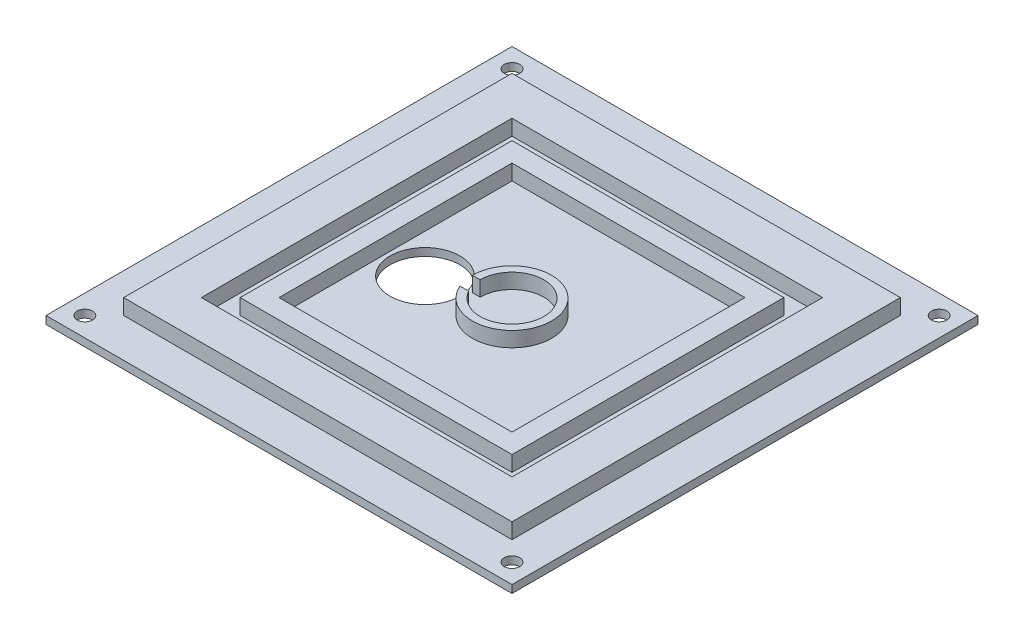
ISO-10303-21;
HEADER;
FILE_DESCRIPTION(('STEP AP214'),'2;1');
FILE_NAME('part.step','',(''),(''),'','','');
FILE_SCHEMA(('AUTOMOTIVE_DESIGN { 1 0 10303 214 1 1 1 1 }'));
ENDSEC;
DATA;
#1=APPLICATION_CONTEXT('core data for automotive mechanical design processes');
#2=APPLICATION_PROTOCOL_DEFINITION('international standard','automotive_design',2000,#1);
#3=PRODUCT_CONTEXT('',#1,'mechanical');
#4=PRODUCT('Part','Part','',(#3));
#5=PRODUCT_RELATED_PRODUCT_CATEGORY('part','',(#4));
#6=PRODUCT_DEFINITION_FORMATION('','',#4);
#7=PRODUCT_DEFINITION_CONTEXT('part definition',#1,'design');
#8=PRODUCT_DEFINITION('design','',#6,#7);
#9=PRODUCT_DEFINITION_SHAPE('','',#8);
#10=(LENGTH_UNIT() NAMED_UNIT(*) SI_UNIT(.MILLI.,.METRE.));
#11=(NAMED_UNIT(*) PLANE_ANGLE_UNIT() SI_UNIT($,.RADIAN.));
#12=(NAMED_UNIT(*) SI_UNIT($,.STERADIAN.) SOLID_ANGLE_UNIT());
#13=UNCERTAINTY_MEASURE_WITH_UNIT(LENGTH_MEASURE(1.E-05),#10,'distance_accuracy_value','');
#14=(GEOMETRIC_REPRESENTATION_CONTEXT(3) GLOBAL_UNCERTAINTY_ASSIGNED_CONTEXT((#13)) GLOBAL_UNIT_ASSIGNED_CONTEXT((#10,
#11,#12)) REPRESENTATION_CONTEXT('',''));
#15=CARTESIAN_POINT('',(0.,0.,0.));
#16=DIRECTION('',(0.,0.,1.));
#17=DIRECTION('',(1.,0.,0.));
#18=AXIS2_PLACEMENT_3D('',#15,#16,#17);
#19=CARTESIAN_POINT('',(0.,0.,0.));
#20=DIRECTION('',(0.,1.,0.));
#21=DIRECTION('',(0.,0.,1.));
#22=AXIS2_PLACEMENT_3D('',#19,#20,#21);
#23=PLANE('',#22);
#24=CARTESIAN_POINT('',(-25.4,0.,3.048));
#25=DIRECTION('',(0.,1.,0.));
#26=DIRECTION('',(0.,0.,1.));
#27=AXIS2_PLACEMENT_3D('',#24,#25,#26);
#28=CIRCLE('',#27,11.43);
#29=CARTESIAN_POINT('',(-25.4,0.,14.478));
#30=VERTEX_POINT('',#29);
#31=EDGE_CURVE('E247',#30,#30,#28,.T.);
#32=ORIENTED_EDGE('',*,*,#31,.F.);
#33=EDGE_LOOP('',(#32));
#34=FACE_BOUND('',#33,.T.);
#35=DIRECTION('',(0.,0.,-1.));
#36=VECTOR('',#35,1.);
#37=CARTESIAN_POINT('',(38.1,0.,-38.1));
#38=LINE('',#37,#36);
#39=CARTESIAN_POINT('',(38.1,0.,38.1));
#40=VERTEX_POINT('',#39);
#41=CARTESIAN_POINT('',(38.1,0.,-38.1));
#42=VERTEX_POINT('',#41);
#43=EDGE_CURVE('E266',#40,#42,#38,.T.);
#44=ORIENTED_EDGE('',*,*,#43,.T.);
#45=DIRECTION('',(-1.,0.,0.));
#46=VECTOR('',#45,1.);
#47=CARTESIAN_POINT('',(-38.1,0.,-38.1));
#48=LINE('',#47,#46);
#49=CARTESIAN_POINT('',(-38.1,0.,-38.1));
#50=VERTEX_POINT('',#49);
#51=EDGE_CURVE('E269',#42,#50,#48,.T.);
#52=ORIENTED_EDGE('',*,*,#51,.T.);
#53=DIRECTION('',(0.,0.,1.));
#54=VECTOR('',#53,1.);
#55=CARTESIAN_POINT('',(-38.1,0.,-38.1));
#56=LINE('',#55,#54);
#57=CARTESIAN_POINT('',(-38.1,0.,38.1));
#58=VERTEX_POINT('',#57);
#59=EDGE_CURVE('E273',#50,#58,#56,.T.);
#60=ORIENTED_EDGE('',*,*,#59,.T.);
#61=DIRECTION('',(1.,0.,0.));
#62=VECTOR('',#61,1.);
#63=CARTESIAN_POINT('',(-38.1,0.,38.1));
#64=LINE('',#63,#62);
#65=EDGE_CURVE('E276',#58,#40,#64,.T.);
#66=ORIENTED_EDGE('',*,*,#65,.T.);
#67=EDGE_LOOP('',(#44,#52,#60,#66));
#68=FACE_BOUND('',#67,.T.);
#69=DIRECTION('',(1.,0.,0.));
#70=VECTOR('',#69,1.);
#71=CARTESIAN_POINT('',(-10.414,0.,0.));
#72=LINE('',#71,#70);
#73=CARTESIAN_POINT('',(-12.954,0.,0.));
#74=VERTEX_POINT('',#73);
#75=CARTESIAN_POINT('',(-10.414,0.,0.));
#76=VERTEX_POINT('',#75);
#77=EDGE_CURVE('E256',#74,#76,#72,.T.);
#78=ORIENTED_EDGE('',*,*,#77,.F.);
#79=CARTESIAN_POINT('',(0.,0.,0.));
#80=DIRECTION('',(0.,1.,0.));
#81=DIRECTION('',(0.,0.,1.));
#82=AXIS2_PLACEMENT_3D('',#79,#80,#81);
#83=CIRCLE('',#82,12.954);
#84=CARTESIAN_POINT('',(-11.9163633714317,0.,5.07999999999999));
#85=VERTEX_POINT('',#84);
#86=EDGE_CURVE('E204',#85,#74,#83,.T.);
#87=ORIENTED_EDGE('',*,*,#86,.F.);
#88=DIRECTION('',(-1.,0.,0.));
#89=VECTOR('',#88,1.);
#90=CARTESIAN_POINT('',(-9.09092932543203,0.,5.07999999999999));
#91=LINE('',#90,#89);
#92=CARTESIAN_POINT('',(-9.09092932543203,0.,5.07999999999999));
#93=VERTEX_POINT('',#92);
#94=EDGE_CURVE('E260',#93,#85,#91,.T.);
#95=ORIENTED_EDGE('',*,*,#94,.F.);
#96=CARTESIAN_POINT('',(0.,0.,0.));
#97=DIRECTION('',(0.,-1.,0.));
#98=DIRECTION('',(0.,0.,1.));
#99=AXIS2_PLACEMENT_3D('',#96,#97,#98);
#100=CIRCLE('',#99,10.414);
#101=EDGE_CURVE('E258',#76,#93,#100,.T.);
#102=ORIENTED_EDGE('',*,*,#101,.F.);
#103=EDGE_LOOP('',(#78,#87,#95,#102));
#104=FACE_BOUND('',#103,.T.);
#105=ADVANCED_FACE('F35',(#34,#68,#104),#23,.T.);
#106=CARTESIAN_POINT('',(0.,0.,0.));
#107=DIRECTION('',(0.,1.,0.));
#108=DIRECTION('',(0.,0.,1.));
#109=AXIS2_PLACEMENT_3D('',#106,#107,#108);
#110=PLANE('',#109);
#111=DIRECTION('',(0.,0.,-1.));
#112=VECTOR('',#111,1.);
#113=CARTESIAN_POINT('',(50.8,0.,-50.8));
#114=LINE('',#113,#112);
#115=CARTESIAN_POINT('',(50.8,0.,50.8));
#116=VERTEX_POINT('',#115);
#117=CARTESIAN_POINT('',(50.8,0.,-50.8));
#118=VERTEX_POINT('',#117);
#119=EDGE_CURVE('E326',#116,#118,#114,.T.);
#120=ORIENTED_EDGE('',*,*,#119,.T.);
#121=DIRECTION('',(-1.,0.,0.));
#122=VECTOR('',#121,1.);
#123=CARTESIAN_POINT('',(-50.8,0.,-50.8));
#124=LINE('',#123,#122);
#125=CARTESIAN_POINT('',(-50.8,0.,-50.8));
#126=VERTEX_POINT('',#125);
#127=EDGE_CURVE('E329',#118,#126,#124,.T.);
#128=ORIENTED_EDGE('',*,*,#127,.T.);
#129=DIRECTION('',(0.,0.,1.));
#130=VECTOR('',#129,1.);
#131=CARTESIAN_POINT('',(-50.8,0.,-50.8));
#132=LINE('',#131,#130);
#133=CARTESIAN_POINT('',(-50.8,0.,50.8));
#134=VERTEX_POINT('',#133);
#135=EDGE_CURVE('E333',#126,#134,#132,.T.);
#136=ORIENTED_EDGE('',*,*,#135,.T.);
#137=DIRECTION('',(1.,0.,0.));
#138=VECTOR('',#137,1.);
#139=CARTESIAN_POINT('',(-50.8,0.,50.8));
#140=LINE('',#139,#138);
#141=EDGE_CURVE('E336',#134,#116,#140,.T.);
#142=ORIENTED_EDGE('',*,*,#141,.T.);
#143=EDGE_LOOP('',(#120,#128,#136,#142));
#144=FACE_BOUND('',#143,.T.);
#145=DIRECTION('',(-1.,0.,0.));
#146=VECTOR('',#145,1.);
#147=CARTESIAN_POINT('',(-44.45,0.,-44.45));
#148=LINE('',#147,#146);
#149=CARTESIAN_POINT('',(44.45,0.,-44.45));
#150=VERTEX_POINT('',#149);
#151=CARTESIAN_POINT('',(-44.45,0.,-44.45));
#152=VERTEX_POINT('',#151);
#153=EDGE_CURVE('E310',#150,#152,#148,.T.);
#154=ORIENTED_EDGE('',*,*,#153,.F.);
#155=DIRECTION('',(0.,0.,-1.));
#156=VECTOR('',#155,1.);
#157=CARTESIAN_POINT('',(44.45,0.,-44.45));
#158=LINE('',#157,#156);
#159=CARTESIAN_POINT('',(44.45,0.,44.45));
#160=VERTEX_POINT('',#159);
#161=EDGE_CURVE('E291',#160,#150,#158,.T.);
#162=ORIENTED_EDGE('',*,*,#161,.F.);
#163=DIRECTION('',(1.,0.,0.));
#164=VECTOR('',#163,1.);
#165=CARTESIAN_POINT('',(-44.45,0.,44.45));
#166=LINE('',#165,#164);
#167=CARTESIAN_POINT('',(-44.45,0.,44.45));
#168=VERTEX_POINT('',#167);
#169=EDGE_CURVE('E301',#168,#160,#166,.T.);
#170=ORIENTED_EDGE('',*,*,#169,.F.);
#171=DIRECTION('',(0.,0.,1.));
#172=VECTOR('',#171,1.);
#173=CARTESIAN_POINT('',(-44.45,0.,-44.45));
#174=LINE('',#173,#172);
#175=EDGE_CURVE('E312',#152,#168,#174,.T.);
#176=ORIENTED_EDGE('',*,*,#175,.F.);
#177=EDGE_LOOP('',(#154,#162,#170,#176));
#178=FACE_BOUND('',#177,.T.);
#179=ADVANCED_FACE('F439',(#144,#178),#110,.T.);
#180=CARTESIAN_POINT('',(76.2,-2.54,-76.2));
#181=DIRECTION('',(1.,0.,0.));
#182=DIRECTION('',(0.,0.,-1.));
#183=AXIS2_PLACEMENT_3D('',#180,#181,#182);
#184=PLANE('',#183);
#185=DIRECTION('',(0.,0.,-1.));
#186=VECTOR('',#185,1.);
#187=CARTESIAN_POINT('',(76.2,0.,-76.2));
#188=LINE('',#187,#186);
#189=CARTESIAN_POINT('',(76.2,0.,76.2));
#190=VERTEX_POINT('',#189);
#191=CARTESIAN_POINT('',(76.2,0.,-76.2));
#192=VERTEX_POINT('',#191);
#193=EDGE_CURVE('E387',#190,#192,#188,.T.);
#194=ORIENTED_EDGE('',*,*,#193,.F.);
#195=DIRECTION('',(0.,1.,0.));
#196=VECTOR('',#195,1.);
#197=CARTESIAN_POINT('',(76.2,-2.54,76.2));
#198=LINE('',#197,#196);
#199=CARTESIAN_POINT('',(76.2,-2.54,76.2));
#200=VERTEX_POINT('',#199);
#201=EDGE_CURVE('E11',#200,#190,#198,.T.);
#202=ORIENTED_EDGE('',*,*,#201,.F.);
#203=DIRECTION('',(0.,0.,-1.));
#204=VECTOR('',#203,1.);
#205=CARTESIAN_POINT('',(76.2,-2.54,-76.2));
#206=LINE('',#205,#204);
#207=CARTESIAN_POINT('',(76.2,-2.54,-76.2));
#208=VERTEX_POINT('',#207);
#209=EDGE_CURVE('E388',#200,#208,#206,.T.);
#210=ORIENTED_EDGE('',*,*,#209,.T.);
#211=DIRECTION('',(0.,1.,0.));
#212=VECTOR('',#211,1.);
#213=CARTESIAN_POINT('',(76.2,-2.54,-76.2));
#214=LINE('',#213,#212);
#215=EDGE_CURVE('E39',#208,#192,#214,.T.);
#216=ORIENTED_EDGE('',*,*,#215,.T.);
#217=EDGE_LOOP('',(#194,#202,#210,#216));
#218=FACE_BOUND('',#217,.T.);
#219=ADVANCED_FACE('F37',(#218),#184,.T.);
#220=CARTESIAN_POINT('',(-76.2,-2.54,76.2));
#221=DIRECTION('',(0.,0.,1.));
#222=DIRECTION('',(1.,0.,0.));
#223=AXIS2_PLACEMENT_3D('',#220,#221,#222);
#224=PLANE('',#223);
#225=DIRECTION('',(1.,0.,0.));
#226=VECTOR('',#225,1.);
#227=CARTESIAN_POINT('',(-76.2,0.,76.2));
#228=LINE('',#227,#226);
#229=CARTESIAN_POINT('',(-76.2,0.,76.2));
#230=VERTEX_POINT('',#229);
#231=EDGE_CURVE('E392',#230,#190,#228,.T.);
#232=ORIENTED_EDGE('',*,*,#231,.F.);
#233=DIRECTION('',(0.,1.,0.));
#234=VECTOR('',#233,1.);
#235=CARTESIAN_POINT('',(-76.2,-2.54,76.2));
#236=LINE('',#235,#234);
#237=CARTESIAN_POINT('',(-76.2,-2.54,76.2));
#238=VERTEX_POINT('',#237);
#239=EDGE_CURVE('E44',#238,#230,#236,.T.);
#240=ORIENTED_EDGE('',*,*,#239,.F.);
#241=DIRECTION('',(1.,0.,0.));
#242=VECTOR('',#241,1.);
#243=CARTESIAN_POINT('',(-76.2,-2.54,76.2));
#244=LINE('',#243,#242);
#245=EDGE_CURVE('E398',#238,#200,#244,.T.);
#246=ORIENTED_EDGE('',*,*,#245,.T.);
#247=ORIENTED_EDGE('',*,*,#201,.T.);
#248=EDGE_LOOP('',(#232,#240,#246,#247));
#249=FACE_BOUND('',#248,.T.);
#250=ADVANCED_FACE('F424',(#249),#224,.T.);
#251=CARTESIAN_POINT('',(-76.2,-2.54,-76.2));
#252=DIRECTION('',(-1.,0.,0.));
#253=DIRECTION('',(0.,0.,1.));
#254=AXIS2_PLACEMENT_3D('',#251,#252,#253);
#255=PLANE('',#254);
#256=DIRECTION('',(0.,0.,1.));
#257=VECTOR('',#256,1.);
#258=CARTESIAN_POINT('',(-76.2,0.,-76.2));
#259=LINE('',#258,#257);
#260=CARTESIAN_POINT('',(-76.2,0.,-76.2));
#261=VERTEX_POINT('',#260);
#262=EDGE_CURVE('E406',#261,#230,#259,.T.);
#263=ORIENTED_EDGE('',*,*,#262,.F.);
#264=DIRECTION('',(0.,1.,0.));
#265=VECTOR('',#264,1.);
#266=CARTESIAN_POINT('',(-76.2,-2.54,-76.2));
#267=LINE('',#266,#265);
#268=CARTESIAN_POINT('',(-76.2,-2.54,-76.2));
#269=VERTEX_POINT('',#268);
#270=EDGE_CURVE('E411',#269,#261,#267,.T.);
#271=ORIENTED_EDGE('',*,*,#270,.F.);
#272=DIRECTION('',(0.,0.,1.));
#273=VECTOR('',#272,1.);
#274=CARTESIAN_POINT('',(-76.2,-2.54,-76.2));
#275=LINE('',#274,#273);
#276=EDGE_CURVE('E395',#269,#238,#275,.T.);
#277=ORIENTED_EDGE('',*,*,#276,.T.);
#278=ORIENTED_EDGE('',*,*,#239,.T.);
#279=EDGE_LOOP('',(#263,#271,#277,#278));
#280=FACE_BOUND('',#279,.T.);
#281=ADVANCED_FACE('F430',(#280),#255,.T.);
#282=CARTESIAN_POINT('',(-76.2,-2.54,-76.2));
#283=DIRECTION('',(0.,0.,-1.));
#284=DIRECTION('',(-1.,0.,0.));
#285=AXIS2_PLACEMENT_3D('',#282,#283,#284);
#286=PLANE('',#285);
#287=DIRECTION('',(-1.,0.,0.));
#288=VECTOR('',#287,1.);
#289=CARTESIAN_POINT('',(-76.2,0.,-76.2));
#290=LINE('',#289,#288);
#291=EDGE_CURVE('E403',#192,#261,#290,.T.);
#292=ORIENTED_EDGE('',*,*,#291,.F.);
#293=ORIENTED_EDGE('',*,*,#215,.F.);
#294=DIRECTION('',(-1.,0.,0.));
#295=VECTOR('',#294,1.);
#296=CARTESIAN_POINT('',(-76.2,-2.54,-76.2));
#297=LINE('',#296,#295);
#298=EDGE_CURVE('E391',#208,#269,#297,.T.);
#299=ORIENTED_EDGE('',*,*,#298,.T.);
#300=ORIENTED_EDGE('',*,*,#270,.T.);
#301=EDGE_LOOP('',(#292,#293,#299,#300));
#302=FACE_BOUND('',#301,.T.);
#303=ADVANCED_FACE('F419',(#302),#286,.T.);
#304=CARTESIAN_POINT('',(0.,-2.54,0.));
#305=DIRECTION('',(0.,1.,0.));
#306=DIRECTION('',(0.,0.,1.));
#307=AXIS2_PLACEMENT_3D('',#304,#305,#306);
#308=PLANE('',#307);
#309=CARTESIAN_POINT('',(-69.85,-2.54,-69.85));
#310=DIRECTION('',(0.,1.,0.));
#311=DIRECTION('',(0.,0.,1.));
#312=AXIS2_PLACEMENT_3D('',#309,#310,#311);
#313=CIRCLE('',#312,2.53999999999999);
#314=CARTESIAN_POINT('',(-69.85,-2.54,-67.31));
#315=VERTEX_POINT('',#314);
#316=EDGE_CURVE('E239',#315,#315,#313,.T.);
#317=ORIENTED_EDGE('',*,*,#316,.T.);
#318=EDGE_LOOP('',(#317));
#319=FACE_BOUND('',#318,.T.);
#320=CARTESIAN_POINT('',(69.85,-2.54,-69.85));
#321=DIRECTION('',(0.,1.,0.));
#322=DIRECTION('',(0.,0.,1.));
#323=AXIS2_PLACEMENT_3D('',#320,#321,#322);
#324=CIRCLE('',#323,2.53999999999999);
#325=CARTESIAN_POINT('',(69.85,-2.54,-67.31));
#326=VERTEX_POINT('',#325);
#327=EDGE_CURVE('E233',#326,#326,#324,.T.);
#328=ORIENTED_EDGE('',*,*,#327,.T.);
#329=EDGE_LOOP('',(#328));
#330=FACE_BOUND('',#329,.T.);
#331=CARTESIAN_POINT('',(69.85,-2.54,69.85));
#332=DIRECTION('',(0.,1.,0.));
#333=DIRECTION('',(0.,0.,1.));
#334=AXIS2_PLACEMENT_3D('',#331,#332,#333);
#335=CIRCLE('',#334,2.53999999999999);
#336=CARTESIAN_POINT('',(69.85,-2.54,72.39));
#337=VERTEX_POINT('',#336);
#338=EDGE_CURVE('E226',#337,#337,#335,.T.);
#339=ORIENTED_EDGE('',*,*,#338,.T.);
#340=EDGE_LOOP('',(#339));
#341=FACE_BOUND('',#340,.T.);
#342=CARTESIAN_POINT('',(-69.85,-2.54,69.85));
#343=DIRECTION('',(0.,1.,0.));
#344=DIRECTION('',(0.,0.,1.));
#345=AXIS2_PLACEMENT_3D('',#342,#343,#344);
#346=CIRCLE('',#345,2.53999999999999);
#347=CARTESIAN_POINT('',(-69.85,-2.54,72.39));
#348=VERTEX_POINT('',#347);
#349=EDGE_CURVE('E244',#348,#348,#346,.T.);
#350=ORIENTED_EDGE('',*,*,#349,.T.);
#351=EDGE_LOOP('',(#350));
#352=FACE_BOUND('',#351,.T.);
#353=CARTESIAN_POINT('',(-25.4,-2.54,3.048));
#354=DIRECTION('',(0.,1.,0.));
#355=DIRECTION('',(0.,0.,1.));
#356=AXIS2_PLACEMENT_3D('',#353,#354,#355);
#357=CIRCLE('',#356,11.43);
#358=CARTESIAN_POINT('',(-25.4,-2.54,14.478));
#359=VERTEX_POINT('',#358);
#360=EDGE_CURVE('E250',#359,#359,#357,.T.);
#361=ORIENTED_EDGE('',*,*,#360,.T.);
#362=EDGE_LOOP('',(#361));
#363=FACE_BOUND('',#362,.T.);
#364=ORIENTED_EDGE('',*,*,#209,.F.);
#365=ORIENTED_EDGE('',*,*,#245,.F.);
#366=ORIENTED_EDGE('',*,*,#276,.F.);
#367=ORIENTED_EDGE('',*,*,#298,.F.);
#368=EDGE_LOOP('',(#364,#365,#366,#367));
#369=FACE_BOUND('',#368,.T.);
#370=ADVANCED_FACE('F427',(#319,#330,#341,#352,#363,#369),#308,.F.);
#371=CARTESIAN_POINT('',(0.,0.,0.));
#372=DIRECTION('',(0.,1.,0.));
#373=DIRECTION('',(0.,0.,1.));
#374=AXIS2_PLACEMENT_3D('',#371,#372,#373);
#375=PLANE('',#374);
#376=CARTESIAN_POINT('',(-69.85,0.,-69.85));
#377=DIRECTION('',(0.,1.,0.));
#378=DIRECTION('',(0.,0.,1.));
#379=AXIS2_PLACEMENT_3D('',#376,#377,#378);
#380=CIRCLE('',#379,2.53999999999999);
#381=CARTESIAN_POINT('',(-69.85,0.,-67.31));
#382=VERTEX_POINT('',#381);
#383=EDGE_CURVE('E225',#382,#382,#380,.T.);
#384=ORIENTED_EDGE('',*,*,#383,.F.);
#385=EDGE_LOOP('',(#384));
#386=FACE_BOUND('',#385,.T.);
#387=CARTESIAN_POINT('',(69.85,0.,-69.85));
#388=DIRECTION('',(0.,1.,0.));
#389=DIRECTION('',(0.,0.,1.));
#390=AXIS2_PLACEMENT_3D('',#387,#388,#389);
#391=CIRCLE('',#390,2.53999999999999);
#392=CARTESIAN_POINT('',(69.85,0.,-67.31));
#393=VERTEX_POINT('',#392);
#394=EDGE_CURVE('E236',#393,#393,#391,.T.);
#395=ORIENTED_EDGE('',*,*,#394,.F.);
#396=EDGE_LOOP('',(#395));
#397=FACE_BOUND('',#396,.T.);
#398=CARTESIAN_POINT('',(69.85,0.,69.85));
#399=DIRECTION('',(0.,1.,0.));
#400=DIRECTION('',(0.,0.,1.));
#401=AXIS2_PLACEMENT_3D('',#398,#399,#400);
#402=CIRCLE('',#401,2.53999999999999);
#403=CARTESIAN_POINT('',(69.85,0.,72.39));
#404=VERTEX_POINT('',#403);
#405=EDGE_CURVE('E230',#404,#404,#402,.T.);
#406=ORIENTED_EDGE('',*,*,#405,.F.);
#407=EDGE_LOOP('',(#406));
#408=FACE_BOUND('',#407,.T.);
#409=CARTESIAN_POINT('',(-69.85,0.,69.85));
#410=DIRECTION('',(0.,1.,0.));
#411=DIRECTION('',(0.,0.,1.));
#412=AXIS2_PLACEMENT_3D('',#409,#410,#411);
#413=CIRCLE('',#412,2.53999999999999);
#414=CARTESIAN_POINT('',(-69.85,0.,72.39));
#415=VERTEX_POINT('',#414);
#416=EDGE_CURVE('E229',#415,#415,#413,.T.);
#417=ORIENTED_EDGE('',*,*,#416,.F.);
#418=EDGE_LOOP('',(#417));
#419=FACE_BOUND('',#418,.T.);
#420=DIRECTION('',(-1.,0.,0.));
#421=VECTOR('',#420,1.);
#422=CARTESIAN_POINT('',(63.5,0.,-63.5));
#423=LINE('',#422,#421);
#424=CARTESIAN_POINT('',(63.5,0.,-63.5));
#425=VERTEX_POINT('',#424);
#426=CARTESIAN_POINT('',(-63.5,0.,-63.5));
#427=VERTEX_POINT('',#426);
#428=EDGE_CURVE('E351',#425,#427,#423,.T.);
#429=ORIENTED_EDGE('',*,*,#428,.F.);
#430=DIRECTION('',(0.,0.,-1.));
#431=VECTOR('',#430,1.);
#432=CARTESIAN_POINT('',(63.5,0.,63.5));
#433=LINE('',#432,#431);
#434=CARTESIAN_POINT('',(63.5,0.,63.5));
#435=VERTEX_POINT('',#434);
#436=EDGE_CURVE('E361',#435,#425,#433,.T.);
#437=ORIENTED_EDGE('',*,*,#436,.F.);
#438=DIRECTION('',(-1.,0.,0.));
#439=VECTOR('',#438,1.);
#440=CARTESIAN_POINT('',(63.5,0.,63.5));
#441=LINE('',#440,#439);
#442=CARTESIAN_POINT('',(-63.5,0.,63.5));
#443=VERTEX_POINT('',#442);
#444=EDGE_CURVE('E374',#435,#443,#441,.T.);
#445=ORIENTED_EDGE('',*,*,#444,.T.);
#446=DIRECTION('',(0.,0.,-1.));
#447=VECTOR('',#446,1.);
#448=CARTESIAN_POINT('',(-63.5,0.,63.5));
#449=LINE('',#448,#447);
#450=EDGE_CURVE('E371',#443,#427,#449,.T.);
#451=ORIENTED_EDGE('',*,*,#450,.T.);
#452=EDGE_LOOP('',(#429,#437,#445,#451));
#453=FACE_BOUND('',#452,.T.);
#454=ORIENTED_EDGE('',*,*,#193,.T.);
#455=ORIENTED_EDGE('',*,*,#291,.T.);
#456=ORIENTED_EDGE('',*,*,#262,.T.);
#457=ORIENTED_EDGE('',*,*,#231,.T.);
#458=EDGE_LOOP('',(#454,#455,#456,#457));
#459=FACE_BOUND('',#458,.T.);
#460=ADVANCED_FACE('F421',(#386,#397,#408,#419,#453,#459),#375,.T.);
#461=CARTESIAN_POINT('',(63.5,5.08,-63.5));
#462=DIRECTION('',(0.,0.,1.));
#463=DIRECTION('',(1.,0.,0.));
#464=AXIS2_PLACEMENT_3D('',#461,#462,#463);
#465=PLANE('',#464);
#466=ORIENTED_EDGE('',*,*,#428,.T.);
#467=DIRECTION('',(0.,-1.,0.));
#468=VECTOR('',#467,1.);
#469=CARTESIAN_POINT('',(-63.5,5.08,-63.5));
#470=LINE('',#469,#468);
#471=CARTESIAN_POINT('',(-63.5,5.08,-63.5));
#472=VERTEX_POINT('',#471);
#473=EDGE_CURVE('E384',#472,#427,#470,.T.);
#474=ORIENTED_EDGE('',*,*,#473,.F.);
#475=DIRECTION('',(-1.,0.,0.));
#476=VECTOR('',#475,1.);
#477=CARTESIAN_POINT('',(63.5,5.08,-63.5));
#478=LINE('',#477,#476);
#479=CARTESIAN_POINT('',(63.5,5.08,-63.5));
#480=VERTEX_POINT('',#479);
#481=EDGE_CURVE('E358',#480,#472,#478,.T.);
#482=ORIENTED_EDGE('',*,*,#481,.F.);
#483=DIRECTION('',(0.,-1.,0.));
#484=VECTOR('',#483,1.);
#485=CARTESIAN_POINT('',(63.5,5.08,-63.5));
#486=LINE('',#485,#484);
#487=EDGE_CURVE('E369',#480,#425,#486,.T.);
#488=ORIENTED_EDGE('',*,*,#487,.T.);
#489=EDGE_LOOP('',(#466,#474,#482,#488));
#490=FACE_BOUND('',#489,.T.);
#491=ADVANCED_FACE('F518',(#490),#465,.F.);
#492=CARTESIAN_POINT('',(-63.5,5.08,63.5));
#493=DIRECTION('',(-1.,0.,0.));
#494=DIRECTION('',(0.,0.,1.));
#495=AXIS2_PLACEMENT_3D('',#492,#493,#494);
#496=PLANE('',#495);
#497=ORIENTED_EDGE('',*,*,#450,.F.);
#498=DIRECTION('',(0.,-1.,0.));
#499=VECTOR('',#498,1.);
#500=CARTESIAN_POINT('',(-63.5,5.08,63.5));
#501=LINE('',#500,#499);
#502=CARTESIAN_POINT('',(-63.5,5.08,63.5));
#503=VERTEX_POINT('',#502);
#504=EDGE_CURVE('E382',#503,#443,#501,.T.);
#505=ORIENTED_EDGE('',*,*,#504,.F.);
#506=DIRECTION('',(0.,0.,-1.));
#507=VECTOR('',#506,1.);
#508=CARTESIAN_POINT('',(-63.5,5.08,63.5));
#509=LINE('',#508,#507);
#510=EDGE_CURVE('E360',#503,#472,#509,.T.);
#511=ORIENTED_EDGE('',*,*,#510,.T.);
#512=ORIENTED_EDGE('',*,*,#473,.T.);
#513=EDGE_LOOP('',(#497,#505,#511,#512));
#514=FACE_BOUND('',#513,.T.);
#515=ADVANCED_FACE('F514',(#514),#496,.T.);
#516=CARTESIAN_POINT('',(63.5,5.08,63.5));
#517=DIRECTION('',(0.,0.,1.));
#518=DIRECTION('',(1.,0.,0.));
#519=AXIS2_PLACEMENT_3D('',#516,#517,#518);
#520=PLANE('',#519);
#521=ORIENTED_EDGE('',*,*,#444,.F.);
#522=DIRECTION('',(0.,-1.,0.));
#523=VECTOR('',#522,1.);
#524=CARTESIAN_POINT('',(63.5,5.08,63.5));
#525=LINE('',#524,#523);
#526=CARTESIAN_POINT('',(63.5,5.08,63.5));
#527=VERTEX_POINT('',#526);
#528=EDGE_CURVE('E380',#527,#435,#525,.T.);
#529=ORIENTED_EDGE('',*,*,#528,.F.);
#530=DIRECTION('',(-1.,0.,0.));
#531=VECTOR('',#530,1.);
#532=CARTESIAN_POINT('',(63.5,5.08,63.5));
#533=LINE('',#532,#531);
#534=EDGE_CURVE('E364',#527,#503,#533,.T.);
#535=ORIENTED_EDGE('',*,*,#534,.T.);
#536=ORIENTED_EDGE('',*,*,#504,.T.);
#537=EDGE_LOOP('',(#521,#529,#535,#536));
#538=FACE_BOUND('',#537,.T.);
#539=ADVANCED_FACE('F510',(#538),#520,.T.);
#540=CARTESIAN_POINT('',(63.5,5.08,63.5));
#541=DIRECTION('',(-1.,0.,0.));
#542=DIRECTION('',(0.,0.,1.));
#543=AXIS2_PLACEMENT_3D('',#540,#541,#542);
#544=PLANE('',#543);
#545=ORIENTED_EDGE('',*,*,#436,.T.);
#546=ORIENTED_EDGE('',*,*,#487,.F.);
#547=DIRECTION('',(0.,0.,-1.));
#548=VECTOR('',#547,1.);
#549=CARTESIAN_POINT('',(63.5,5.08,63.5));
#550=LINE('',#549,#548);
#551=EDGE_CURVE('E367',#527,#480,#550,.T.);
#552=ORIENTED_EDGE('',*,*,#551,.F.);
#553=ORIENTED_EDGE('',*,*,#528,.T.);
#554=EDGE_LOOP('',(#545,#546,#552,#553));
#555=FACE_BOUND('',#554,.T.);
#556=ADVANCED_FACE('F506',(#555),#544,.F.);
#557=CARTESIAN_POINT('',(0.,5.08,0.));
#558=DIRECTION('',(0.,-1.,0.));
#559=DIRECTION('',(0.,0.,-1.));
#560=AXIS2_PLACEMENT_3D('',#557,#558,#559);
#561=PLANE('',#560);
#562=DIRECTION('',(-1.,0.,0.));
#563=VECTOR('',#562,1.);
#564=CARTESIAN_POINT('',(-50.8,5.08,-50.8));
#565=LINE('',#564,#563);
#566=CARTESIAN_POINT('',(50.8,5.08,-50.8));
#567=VERTEX_POINT('',#566);
#568=CARTESIAN_POINT('',(-50.8,5.08,-50.8));
#569=VERTEX_POINT('',#568);
#570=EDGE_CURVE('E341',#567,#569,#565,.T.);
#571=ORIENTED_EDGE('',*,*,#570,.F.);
#572=DIRECTION('',(0.,0.,-1.));
#573=VECTOR('',#572,1.);
#574=CARTESIAN_POINT('',(50.8,5.08,-50.8));
#575=LINE('',#574,#573);
#576=CARTESIAN_POINT('',(50.8,5.08,50.8));
#577=VERTEX_POINT('',#576);
#578=EDGE_CURVE('E325',#577,#567,#575,.T.);
#579=ORIENTED_EDGE('',*,*,#578,.F.);
#580=DIRECTION('',(1.,0.,0.));
#581=VECTOR('',#580,1.);
#582=CARTESIAN_POINT('',(-50.8,5.08,50.8));
#583=LINE('',#582,#581);
#584=CARTESIAN_POINT('',(-50.8,5.08,50.8));
#585=VERTEX_POINT('',#584);
#586=EDGE_CURVE('E330',#585,#577,#583,.T.);
#587=ORIENTED_EDGE('',*,*,#586,.F.);
#588=DIRECTION('',(0.,0.,1.));
#589=VECTOR('',#588,1.);
#590=CARTESIAN_POINT('',(-50.8,5.08,-50.8));
#591=LINE('',#590,#589);
#592=EDGE_CURVE('E344',#569,#585,#591,.T.);
#593=ORIENTED_EDGE('',*,*,#592,.F.);
#594=EDGE_LOOP('',(#571,#579,#587,#593));
#595=FACE_BOUND('',#594,.T.);
#596=ORIENTED_EDGE('',*,*,#481,.T.);
#597=ORIENTED_EDGE('',*,*,#510,.F.);
#598=ORIENTED_EDGE('',*,*,#534,.F.);
#599=ORIENTED_EDGE('',*,*,#551,.T.);
#600=EDGE_LOOP('',(#596,#597,#598,#599));
#601=FACE_BOUND('',#600,.T.);
#602=ADVANCED_FACE('F502',(#595,#601),#561,.F.);
#603=CARTESIAN_POINT('',(50.8,0.,-50.8));
#604=DIRECTION('',(1.,0.,0.));
#605=DIRECTION('',(0.,0.,-1.));
#606=AXIS2_PLACEMENT_3D('',#603,#604,#605);
#607=PLANE('',#606);
#608=ORIENTED_EDGE('',*,*,#578,.T.);
#609=DIRECTION('',(0.,1.,0.));
#610=VECTOR('',#609,1.);
#611=CARTESIAN_POINT('',(50.8,0.,-50.8));
#612=LINE('',#611,#610);
#613=EDGE_CURVE('E339',#118,#567,#612,.T.);
#614=ORIENTED_EDGE('',*,*,#613,.F.);
#615=ORIENTED_EDGE('',*,*,#119,.F.);
#616=DIRECTION('',(0.,1.,0.));
#617=VECTOR('',#616,1.);
#618=CARTESIAN_POINT('',(50.8,0.,50.8));
#619=LINE('',#618,#617);
#620=EDGE_CURVE('E349',#116,#577,#619,.T.);
#621=ORIENTED_EDGE('',*,*,#620,.T.);
#622=EDGE_LOOP('',(#608,#614,#615,#621));
#623=FACE_BOUND('',#622,.T.);
#624=ADVANCED_FACE('F492',(#623),#607,.F.);
#625=CARTESIAN_POINT('',(-50.8,0.,50.8));
#626=DIRECTION('',(0.,0.,1.));
#627=DIRECTION('',(1.,0.,0.));
#628=AXIS2_PLACEMENT_3D('',#625,#626,#627);
#629=PLANE('',#628);
#630=ORIENTED_EDGE('',*,*,#586,.T.);
#631=ORIENTED_EDGE('',*,*,#620,.F.);
#632=ORIENTED_EDGE('',*,*,#141,.F.);
#633=DIRECTION('',(0.,1.,0.));
#634=VECTOR('',#633,1.);
#635=CARTESIAN_POINT('',(-50.8,0.,50.8));
#636=LINE('',#635,#634);
#637=EDGE_CURVE('E352',#134,#585,#636,.T.);
#638=ORIENTED_EDGE('',*,*,#637,.T.);
#639=EDGE_LOOP('',(#630,#631,#632,#638));
#640=FACE_BOUND('',#639,.T.);
#641=ADVANCED_FACE('F488',(#640),#629,.F.);
#642=CARTESIAN_POINT('',(-50.8,0.,-50.8));
#643=DIRECTION('',(-1.,0.,0.));
#644=DIRECTION('',(0.,0.,1.));
#645=AXIS2_PLACEMENT_3D('',#642,#643,#644);
#646=PLANE('',#645);
#647=ORIENTED_EDGE('',*,*,#592,.T.);
#648=ORIENTED_EDGE('',*,*,#637,.F.);
#649=ORIENTED_EDGE('',*,*,#135,.F.);
#650=DIRECTION('',(0.,1.,0.));
#651=VECTOR('',#650,1.);
#652=CARTESIAN_POINT('',(-50.8,0.,-50.8));
#653=LINE('',#652,#651);
#654=EDGE_CURVE('E354',#126,#569,#653,.T.);
#655=ORIENTED_EDGE('',*,*,#654,.T.);
#656=EDGE_LOOP('',(#647,#648,#649,#655));
#657=FACE_BOUND('',#656,.T.);
#658=ADVANCED_FACE('F491',(#657),#646,.F.);
#659=CARTESIAN_POINT('',(-50.8,0.,-50.8));
#660=DIRECTION('',(0.,0.,-1.));
#661=DIRECTION('',(-1.,0.,0.));
#662=AXIS2_PLACEMENT_3D('',#659,#660,#661);
#663=PLANE('',#662);
#664=ORIENTED_EDGE('',*,*,#570,.T.);
#665=ORIENTED_EDGE('',*,*,#654,.F.);
#666=ORIENTED_EDGE('',*,*,#127,.F.);
#667=ORIENTED_EDGE('',*,*,#613,.T.);
#668=EDGE_LOOP('',(#664,#665,#666,#667));
#669=FACE_BOUND('',#668,.T.);
#670=ADVANCED_FACE('F485',(#669),#663,.F.);
#671=CARTESIAN_POINT('',(44.45,5.07999999999997,-44.45));
#672=DIRECTION('',(-1.,0.,0.));
#673=DIRECTION('',(0.,0.,1.));
#674=AXIS2_PLACEMENT_3D('',#671,#672,#673);
#675=PLANE('',#674);
#676=ORIENTED_EDGE('',*,*,#161,.T.);
#677=DIRECTION('',(0.,-1.,0.));
#678=VECTOR('',#677,1.);
#679=CARTESIAN_POINT('',(44.45,5.07999999999997,-44.45));
#680=LINE('',#679,#678);
#681=CARTESIAN_POINT('',(44.45,5.07999999999997,-44.45));
#682=VERTEX_POINT('',#681);
#683=EDGE_CURVE('E323',#682,#150,#680,.T.);
#684=ORIENTED_EDGE('',*,*,#683,.F.);
#685=DIRECTION('',(0.,0.,-1.));
#686=VECTOR('',#685,1.);
#687=CARTESIAN_POINT('',(44.45,5.07999999999997,-44.45));
#688=LINE('',#687,#686);
#689=CARTESIAN_POINT('',(44.45,5.07999999999997,44.45));
#690=VERTEX_POINT('',#689);
#691=EDGE_CURVE('E297',#690,#682,#688,.T.);
#692=ORIENTED_EDGE('',*,*,#691,.F.);
#693=DIRECTION('',(0.,-1.,0.));
#694=VECTOR('',#693,1.);
#695=CARTESIAN_POINT('',(44.45,5.07999999999997,44.45));
#696=LINE('',#695,#694);
#697=EDGE_CURVE('E307',#690,#160,#696,.T.);
#698=ORIENTED_EDGE('',*,*,#697,.T.);
#699=EDGE_LOOP('',(#676,#684,#692,#698));
#700=FACE_BOUND('',#699,.T.);
#701=ADVANCED_FACE('F482',(#700),#675,.F.);
#702=CARTESIAN_POINT('',(-44.45,5.07999999999997,-44.45));
#703=DIRECTION('',(0.,0.,1.));
#704=DIRECTION('',(1.,0.,0.));
#705=AXIS2_PLACEMENT_3D('',#702,#703,#704);
#706=PLANE('',#705);
#707=ORIENTED_EDGE('',*,*,#153,.T.);
#708=DIRECTION('',(0.,-1.,0.));
#709=VECTOR('',#708,1.);
#710=CARTESIAN_POINT('',(-44.45,5.07999999999997,-44.45));
#711=LINE('',#710,#709);
#712=CARTESIAN_POINT('',(-44.45,5.07999999999997,-44.45));
#713=VERTEX_POINT('',#712);
#714=EDGE_CURVE('E320',#713,#152,#711,.T.);
#715=ORIENTED_EDGE('',*,*,#714,.F.);
#716=DIRECTION('',(-1.,0.,0.));
#717=VECTOR('',#716,1.);
#718=CARTESIAN_POINT('',(-44.45,5.07999999999997,-44.45));
#719=LINE('',#718,#717);
#720=EDGE_CURVE('E300',#682,#713,#719,.T.);
#721=ORIENTED_EDGE('',*,*,#720,.F.);
#722=ORIENTED_EDGE('',*,*,#683,.T.);
#723=EDGE_LOOP('',(#707,#715,#721,#722));
#724=FACE_BOUND('',#723,.T.);
#725=ADVANCED_FACE('F478',(#724),#706,.F.);
#726=CARTESIAN_POINT('',(-44.45,5.07999999999997,-44.45));
#727=DIRECTION('',(1.,0.,0.));
#728=DIRECTION('',(0.,0.,-1.));
#729=AXIS2_PLACEMENT_3D('',#726,#727,#728);
#730=PLANE('',#729);
#731=ORIENTED_EDGE('',*,*,#175,.T.);
#732=DIRECTION('',(0.,-1.,0.));
#733=VECTOR('',#732,1.);
#734=CARTESIAN_POINT('',(-44.45,5.07999999999997,44.45));
#735=LINE('',#734,#733);
#736=CARTESIAN_POINT('',(-44.45,5.07999999999997,44.45));
#737=VERTEX_POINT('',#736);
#738=EDGE_CURVE('E318',#737,#168,#735,.T.);
#739=ORIENTED_EDGE('',*,*,#738,.F.);
#740=DIRECTION('',(0.,0.,1.));
#741=VECTOR('',#740,1.);
#742=CARTESIAN_POINT('',(-44.45,5.07999999999997,-44.45));
#743=LINE('',#742,#741);
#744=EDGE_CURVE('E303',#713,#737,#743,.T.);
#745=ORIENTED_EDGE('',*,*,#744,.F.);
#746=ORIENTED_EDGE('',*,*,#714,.T.);
#747=EDGE_LOOP('',(#731,#739,#745,#746));
#748=FACE_BOUND('',#747,.T.);
#749=ADVANCED_FACE('F474',(#748),#730,.F.);
#750=CARTESIAN_POINT('',(-44.45,5.07999999999997,44.45));
#751=DIRECTION('',(0.,0.,-1.));
#752=DIRECTION('',(-1.,0.,0.));
#753=AXIS2_PLACEMENT_3D('',#750,#751,#752);
#754=PLANE('',#753);
#755=ORIENTED_EDGE('',*,*,#169,.T.);
#756=ORIENTED_EDGE('',*,*,#697,.F.);
#757=DIRECTION('',(1.,0.,0.));
#758=VECTOR('',#757,1.);
#759=CARTESIAN_POINT('',(-44.45,5.07999999999997,44.45));
#760=LINE('',#759,#758);
#761=EDGE_CURVE('E305',#737,#690,#760,.T.);
#762=ORIENTED_EDGE('',*,*,#761,.F.);
#763=ORIENTED_EDGE('',*,*,#738,.T.);
#764=EDGE_LOOP('',(#755,#756,#762,#763));
#765=FACE_BOUND('',#764,.T.);
#766=ADVANCED_FACE('F470',(#765),#754,.F.);
#767=CARTESIAN_POINT('',(0.,5.07999999999997,0.));
#768=DIRECTION('',(0.,1.,0.));
#769=DIRECTION('',(0.,0.,1.));
#770=AXIS2_PLACEMENT_3D('',#767,#768,#769);
#771=PLANE('',#770);
#772=DIRECTION('',(0.,0.,-1.));
#773=VECTOR('',#772,1.);
#774=CARTESIAN_POINT('',(38.1,5.07999999999997,-38.1));
#775=LINE('',#774,#773);
#776=CARTESIAN_POINT('',(38.1,5.07999999999997,38.1));
#777=VERTEX_POINT('',#776);
#778=CARTESIAN_POINT('',(38.1,5.07999999999997,-38.1));
#779=VERTEX_POINT('',#778);
#780=EDGE_CURVE('E60',#777,#779,#775,.T.);
#781=ORIENTED_EDGE('',*,*,#780,.F.);
#782=DIRECTION('',(1.,0.,0.));
#783=VECTOR('',#782,1.);
#784=CARTESIAN_POINT('',(-38.1,5.07999999999997,38.1));
#785=LINE('',#784,#783);
#786=CARTESIAN_POINT('',(-38.1,5.07999999999997,38.1));
#787=VERTEX_POINT('',#786);
#788=EDGE_CURVE('E270',#787,#777,#785,.T.);
#789=ORIENTED_EDGE('',*,*,#788,.F.);
#790=DIRECTION('',(0.,0.,1.));
#791=VECTOR('',#790,1.);
#792=CARTESIAN_POINT('',(-38.1,5.07999999999997,-38.1));
#793=LINE('',#792,#791);
#794=CARTESIAN_POINT('',(-38.1,5.07999999999997,-38.1));
#795=VERTEX_POINT('',#794);
#796=EDGE_CURVE('E284',#795,#787,#793,.T.);
#797=ORIENTED_EDGE('',*,*,#796,.F.);
#798=DIRECTION('',(-1.,0.,0.));
#799=VECTOR('',#798,1.);
#800=CARTESIAN_POINT('',(-38.1,5.07999999999997,-38.1));
#801=LINE('',#800,#799);
#802=EDGE_CURVE('E281',#779,#795,#801,.T.);
#803=ORIENTED_EDGE('',*,*,#802,.F.);
#804=EDGE_LOOP('',(#781,#789,#797,#803));
#805=FACE_BOUND('',#804,.T.);
#806=ORIENTED_EDGE('',*,*,#691,.T.);
#807=ORIENTED_EDGE('',*,*,#720,.T.);
#808=ORIENTED_EDGE('',*,*,#744,.T.);
#809=ORIENTED_EDGE('',*,*,#761,.T.);
#810=EDGE_LOOP('',(#806,#807,#808,#809));
#811=FACE_BOUND('',#810,.T.);
#812=ADVANCED_FACE('F467',(#805,#811),#771,.T.);
#813=CARTESIAN_POINT('',(38.1,0.,-38.1));
#814=DIRECTION('',(1.,0.,0.));
#815=DIRECTION('',(0.,0.,-1.));
#816=AXIS2_PLACEMENT_3D('',#813,#814,#815);
#817=PLANE('',#816);
#818=ORIENTED_EDGE('',*,*,#780,.T.);
#819=DIRECTION('',(0.,1.,0.));
#820=VECTOR('',#819,1.);
#821=CARTESIAN_POINT('',(38.1,0.,-38.1));
#822=LINE('',#821,#820);
#823=EDGE_CURVE('E279',#42,#779,#822,.T.);
#824=ORIENTED_EDGE('',*,*,#823,.F.);
#825=ORIENTED_EDGE('',*,*,#43,.F.);
#826=DIRECTION('',(0.,1.,0.));
#827=VECTOR('',#826,1.);
#828=CARTESIAN_POINT('',(38.1,0.,38.1));
#829=LINE('',#828,#827);
#830=EDGE_CURVE('E289',#40,#777,#829,.T.);
#831=ORIENTED_EDGE('',*,*,#830,.T.);
#832=EDGE_LOOP('',(#818,#824,#825,#831));
#833=FACE_BOUND('',#832,.T.);
#834=ADVANCED_FACE('F456',(#833),#817,.F.);
#835=CARTESIAN_POINT('',(-38.1,0.,38.1));
#836=DIRECTION('',(0.,0.,1.));
#837=DIRECTION('',(1.,0.,0.));
#838=AXIS2_PLACEMENT_3D('',#835,#836,#837);
#839=PLANE('',#838);
#840=ORIENTED_EDGE('',*,*,#788,.T.);
#841=ORIENTED_EDGE('',*,*,#830,.F.);
#842=ORIENTED_EDGE('',*,*,#65,.F.);
#843=DIRECTION('',(0.,1.,0.));
#844=VECTOR('',#843,1.);
#845=CARTESIAN_POINT('',(-38.1,0.,38.1));
#846=LINE('',#845,#844);
#847=EDGE_CURVE('E292',#58,#787,#846,.T.);
#848=ORIENTED_EDGE('',*,*,#847,.T.);
#849=EDGE_LOOP('',(#840,#841,#842,#848));
#850=FACE_BOUND('',#849,.T.);
#851=ADVANCED_FACE('F452',(#850),#839,.F.);
#852=CARTESIAN_POINT('',(-38.1,0.,-38.1));
#853=DIRECTION('',(-1.,0.,0.));
#854=DIRECTION('',(0.,0.,1.));
#855=AXIS2_PLACEMENT_3D('',#852,#853,#854);
#856=PLANE('',#855);
#857=ORIENTED_EDGE('',*,*,#796,.T.);
#858=ORIENTED_EDGE('',*,*,#847,.F.);
#859=ORIENTED_EDGE('',*,*,#59,.F.);
#860=DIRECTION('',(0.,1.,0.));
#861=VECTOR('',#860,1.);
#862=CARTESIAN_POINT('',(-38.1,0.,-38.1));
#863=LINE('',#862,#861);
#864=EDGE_CURVE('E294',#50,#795,#863,.T.);
#865=ORIENTED_EDGE('',*,*,#864,.T.);
#866=EDGE_LOOP('',(#857,#858,#859,#865));
#867=FACE_BOUND('',#866,.T.);
#868=ADVANCED_FACE('F455',(#867),#856,.F.);
#869=CARTESIAN_POINT('',(-38.1,0.,-38.1));
#870=DIRECTION('',(0.,0.,-1.));
#871=DIRECTION('',(-1.,0.,0.));
#872=AXIS2_PLACEMENT_3D('',#869,#870,#871);
#873=PLANE('',#872);
#874=ORIENTED_EDGE('',*,*,#802,.T.);
#875=ORIENTED_EDGE('',*,*,#864,.F.);
#876=ORIENTED_EDGE('',*,*,#51,.F.);
#877=ORIENTED_EDGE('',*,*,#823,.T.);
#878=EDGE_LOOP('',(#874,#875,#876,#877));
#879=FACE_BOUND('',#878,.T.);
#880=ADVANCED_FACE('F460',(#879),#873,.F.);
#881=CARTESIAN_POINT('',(0.,2.794,0.));
#882=DIRECTION('',(0.,-1.,0.));
#883=DIRECTION('',(0.,0.,-1.));
#884=AXIS2_PLACEMENT_3D('',#881,#882,#883);
#885=CYLINDRICAL_SURFACE('',#884,12.954);
#886=ORIENTED_EDGE('',*,*,#86,.T.);
#887=DIRECTION('',(0.,-1.,0.));
#888=VECTOR('',#887,1.);
#889=CARTESIAN_POINT('',(-12.954,2.794,0.));
#890=LINE('',#889,#888);
#891=CARTESIAN_POINT('',(-12.954,4.9276,0.));
#892=VERTEX_POINT('',#891);
#893=EDGE_CURVE('E197',#892,#74,#890,.T.);
#894=ORIENTED_EDGE('',*,*,#893,.F.);
#895=CARTESIAN_POINT('',(0.,4.9276,0.));
#896=DIRECTION('',(0.,1.,0.));
#897=DIRECTION('',(0.,0.,1.));
#898=AXIS2_PLACEMENT_3D('',#895,#896,#897);
#899=CIRCLE('',#898,12.954);
#900=CARTESIAN_POINT('',(-11.9163633714317,4.9276,5.07999999999999));
#901=VERTEX_POINT('',#900);
#902=EDGE_CURVE('E202',#901,#892,#899,.T.);
#903=ORIENTED_EDGE('',*,*,#902,.F.);
#904=DIRECTION('',(0.,-1.,0.));
#905=VECTOR('',#904,1.);
#906=CARTESIAN_POINT('',(-11.9163633714317,2.794,5.07999999999999));
#907=LINE('',#906,#905);
#908=EDGE_CURVE('E262',#901,#85,#907,.T.);
#909=ORIENTED_EDGE('',*,*,#908,.T.);
#910=EDGE_LOOP('',(#886,#894,#903,#909));
#911=FACE_BOUND('',#910,.T.);
#912=ADVANCED_FACE('F199',(#911),#885,.T.);
#913=CARTESIAN_POINT('',(-10.414,2.794,0.));
#914=DIRECTION('',(0.,0.,-1.));
#915=DIRECTION('',(-1.,0.,0.));
#916=AXIS2_PLACEMENT_3D('',#913,#914,#915);
#917=PLANE('',#916);
#918=ORIENTED_EDGE('',*,*,#77,.T.);
#919=DIRECTION('',(0.,-1.,0.));
#920=VECTOR('',#919,1.);
#921=CARTESIAN_POINT('',(-10.414,2.794,0.));
#922=LINE('',#921,#920);
#923=CARTESIAN_POINT('',(-10.414,4.9276,0.));
#924=VERTEX_POINT('',#923);
#925=EDGE_CURVE('E207',#924,#76,#922,.T.);
#926=ORIENTED_EDGE('',*,*,#925,.F.);
#927=DIRECTION('',(1.,0.,0.));
#928=VECTOR('',#927,1.);
#929=CARTESIAN_POINT('',(-10.414,4.9276,0.));
#930=LINE('',#929,#928);
#931=EDGE_CURVE('E210',#892,#924,#930,.T.);
#932=ORIENTED_EDGE('',*,*,#931,.F.);
#933=ORIENTED_EDGE('',*,*,#893,.T.);
#934=EDGE_LOOP('',(#918,#926,#932,#933));
#935=FACE_BOUND('',#934,.T.);
#936=ADVANCED_FACE('F211',(#935),#917,.F.);
#937=CARTESIAN_POINT('',(0.,2.794,0.));
#938=DIRECTION('',(0.,-1.,0.));
#939=DIRECTION('',(0.,0.,-1.));
#940=AXIS2_PLACEMENT_3D('',#937,#938,#939);
#941=CYLINDRICAL_SURFACE('',#940,10.414);
#942=ORIENTED_EDGE('',*,*,#101,.T.);
#943=DIRECTION('',(0.,-1.,0.));
#944=VECTOR('',#943,1.);
#945=CARTESIAN_POINT('',(-9.09092932543203,2.794,5.07999999999999));
#946=LINE('',#945,#944);
#947=CARTESIAN_POINT('',(-9.09092932543203,4.9276,5.07999999999999));
#948=VERTEX_POINT('',#947);
#949=EDGE_CURVE('E52',#948,#93,#946,.T.);
#950=ORIENTED_EDGE('',*,*,#949,.F.);
#951=CARTESIAN_POINT('',(0.,4.9276,0.));
#952=DIRECTION('',(0.,-1.,0.));
#953=DIRECTION('',(0.,0.,1.));
#954=AXIS2_PLACEMENT_3D('',#951,#952,#953);
#955=CIRCLE('',#954,10.414);
#956=EDGE_CURVE('E216',#924,#948,#955,.T.);
#957=ORIENTED_EDGE('',*,*,#956,.F.);
#958=ORIENTED_EDGE('',*,*,#925,.T.);
#959=EDGE_LOOP('',(#942,#950,#957,#958));
#960=FACE_BOUND('',#959,.T.);
#961=ADVANCED_FACE('F573',(#960),#941,.F.);
#962=CARTESIAN_POINT('',(-9.09092932543203,2.794,5.07999999999999));
#963=DIRECTION('',(0.,0.,1.));
#964=DIRECTION('',(1.,0.,0.));
#965=AXIS2_PLACEMENT_3D('',#962,#963,#964);
#966=PLANE('',#965);
#967=ORIENTED_EDGE('',*,*,#94,.T.);
#968=ORIENTED_EDGE('',*,*,#908,.F.);
#969=DIRECTION('',(-1.,0.,0.));
#970=VECTOR('',#969,1.);
#971=CARTESIAN_POINT('',(-9.09092932543203,4.9276,5.07999999999999));
#972=LINE('',#971,#970);
#973=EDGE_CURVE('E220',#948,#901,#972,.T.);
#974=ORIENTED_EDGE('',*,*,#973,.F.);
#975=ORIENTED_EDGE('',*,*,#949,.T.);
#976=EDGE_LOOP('',(#967,#968,#974,#975));
#977=FACE_BOUND('',#976,.T.);
#978=ADVANCED_FACE('F563',(#977),#966,.F.);
#979=CARTESIAN_POINT('',(-25.4,-2.54,3.048));
#980=DIRECTION('',(0.,1.,0.));
#981=DIRECTION('',(0.,0.,1.));
#982=AXIS2_PLACEMENT_3D('',#979,#980,#981);
#983=CYLINDRICAL_SURFACE('',#982,11.43);
#984=ORIENTED_EDGE('',*,*,#360,.F.);
#985=EDGE_LOOP('',(#984));
#986=FACE_BOUND('',#985,.T.);
#987=ORIENTED_EDGE('',*,*,#31,.T.);
#988=EDGE_LOOP('',(#987));
#989=FACE_BOUND('',#988,.T.);
#990=ADVANCED_FACE('F553',(#986,#989),#983,.F.);
#991=CARTESIAN_POINT('',(-69.85,-2.54,69.85));
#992=DIRECTION('',(0.,1.,0.));
#993=DIRECTION('',(0.,0.,1.));
#994=AXIS2_PLACEMENT_3D('',#991,#992,#993);
#995=CYLINDRICAL_SURFACE('',#994,2.53999999999999);
#996=ORIENTED_EDGE('',*,*,#349,.F.);
#997=EDGE_LOOP('',(#996));
#998=FACE_BOUND('',#997,.T.);
#999=ORIENTED_EDGE('',*,*,#416,.T.);
#1000=EDGE_LOOP('',(#999));
#1001=FACE_BOUND('',#1000,.T.);
#1002=ADVANCED_FACE('F550',(#998,#1001),#995,.F.);
#1003=CARTESIAN_POINT('',(69.85,-2.54,69.85));
#1004=DIRECTION('',(0.,1.,0.));
#1005=DIRECTION('',(0.,0.,1.));
#1006=AXIS2_PLACEMENT_3D('',#1003,#1004,#1005);
#1007=CYLINDRICAL_SURFACE('',#1006,2.53999999999999);
#1008=ORIENTED_EDGE('',*,*,#338,.F.);
#1009=EDGE_LOOP('',(#1008));
#1010=FACE_BOUND('',#1009,.T.);
#1011=ORIENTED_EDGE('',*,*,#405,.T.);
#1012=EDGE_LOOP('',(#1011));
#1013=FACE_BOUND('',#1012,.T.);
#1014=ADVANCED_FACE('F552',(#1010,#1013),#1007,.F.);
#1015=CARTESIAN_POINT('',(69.85,-2.54,-69.85));
#1016=DIRECTION('',(0.,1.,0.));
#1017=DIRECTION('',(0.,0.,1.));
#1018=AXIS2_PLACEMENT_3D('',#1015,#1016,#1017);
#1019=CYLINDRICAL_SURFACE('',#1018,2.53999999999999);
#1020=ORIENTED_EDGE('',*,*,#327,.F.);
#1021=EDGE_LOOP('',(#1020));
#1022=FACE_BOUND('',#1021,.T.);
#1023=ORIENTED_EDGE('',*,*,#394,.T.);
#1024=EDGE_LOOP('',(#1023));
#1025=FACE_BOUND('',#1024,.T.);
#1026=ADVANCED_FACE('F560',(#1022,#1025),#1019,.F.);
#1027=CARTESIAN_POINT('',(-69.85,-2.54,-69.85));
#1028=DIRECTION('',(0.,1.,0.));
#1029=DIRECTION('',(0.,0.,1.));
#1030=AXIS2_PLACEMENT_3D('',#1027,#1028,#1029);
#1031=CYLINDRICAL_SURFACE('',#1030,2.53999999999999);
#1032=ORIENTED_EDGE('',*,*,#316,.F.);
#1033=EDGE_LOOP('',(#1032));
#1034=FACE_BOUND('',#1033,.T.);
#1035=ORIENTED_EDGE('',*,*,#383,.T.);
#1036=EDGE_LOOP('',(#1035));
#1037=FACE_BOUND('',#1036,.T.);
#1038=ADVANCED_FACE('F568',(#1034,#1037),#1031,.F.);
#1039=CARTESIAN_POINT('',(0.,4.9276,0.));
#1040=DIRECTION('',(0.,1.,0.));
#1041=DIRECTION('',(0.,0.,1.));
#1042=AXIS2_PLACEMENT_3D('',#1039,#1040,#1041);
#1043=PLANE('',#1042);
#1044=ORIENTED_EDGE('',*,*,#902,.T.);
#1045=ORIENTED_EDGE('',*,*,#931,.T.);
#1046=ORIENTED_EDGE('',*,*,#956,.T.);
#1047=ORIENTED_EDGE('',*,*,#973,.T.);
#1048=EDGE_LOOP('',(#1044,#1045,#1046,#1047));
#1049=FACE_BOUND('',#1048,.T.);
#1050=ADVANCED_FACE('F219',(#1049),#1043,.T.);
#1051=CLOSED_SHELL('',(#105,#179,#219,#250,#281,#303,#370,#460,#491,#515,#539,#556,#602,#624,
#641,#658,#670,#701,#725,#749,#766,#812,#834,#851,#868,#880,#912,#936,#961,#978,#990,#1002,
#1014,#1026,#1038,#1050));
#1052=MANIFOLD_SOLID_BREP('B2',#1051);
#1053=ADVANCED_BREP_SHAPE_REPRESENTATION('',(#18,#1052),#14);
#1054=SHAPE_DEFINITION_REPRESENTATION(#9,#1053);
ENDSEC;
END-ISO-10303-21;
